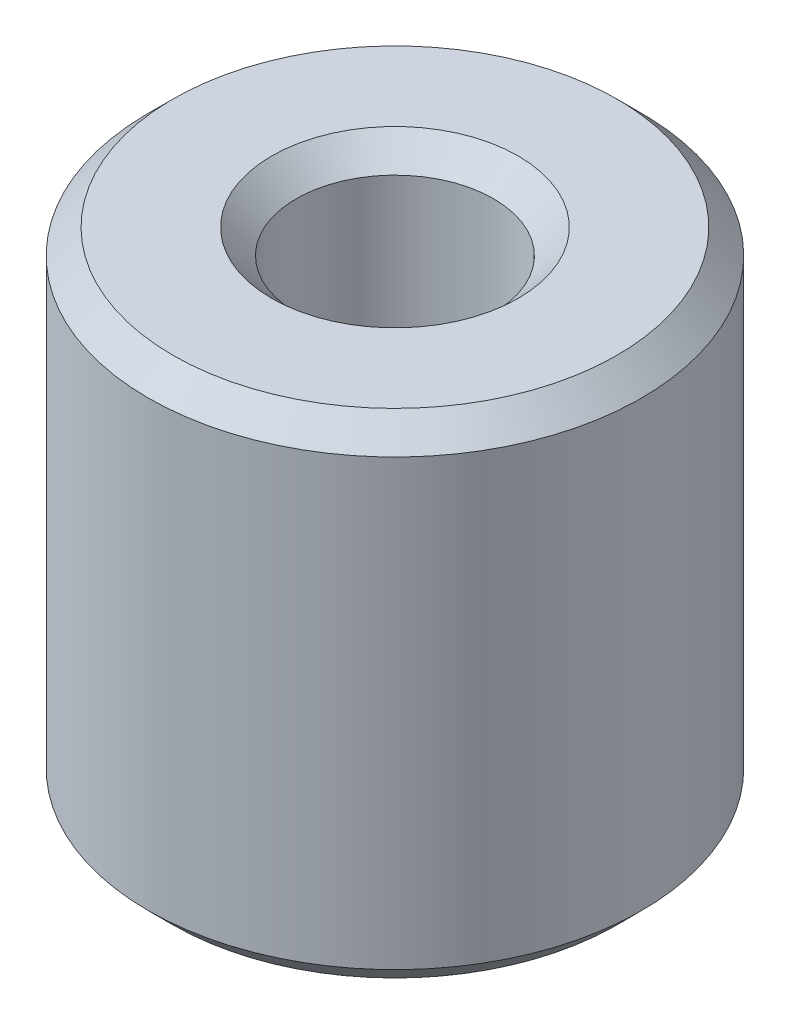
ISO-10303-21;
HEADER;
FILE_DESCRIPTION(('STEP AP214'),'2;1');
FILE_NAME('part.step','',(''),(''),'','','');
FILE_SCHEMA(('AUTOMOTIVE_DESIGN { 1 0 10303 214 1 1 1 1 }'));
ENDSEC;
DATA;
#1=APPLICATION_CONTEXT('core data for automotive mechanical design processes');
#2=APPLICATION_PROTOCOL_DEFINITION('international standard','automotive_design',2000,#1);
#3=PRODUCT_CONTEXT('',#1,'mechanical');
#4=PRODUCT('Part','Part','',(#3));
#5=PRODUCT_RELATED_PRODUCT_CATEGORY('part','',(#4));
#6=PRODUCT_DEFINITION_FORMATION('','',#4);
#7=PRODUCT_DEFINITION_CONTEXT('part definition',#1,'design');
#8=PRODUCT_DEFINITION('design','',#6,#7);
#9=PRODUCT_DEFINITION_SHAPE('','',#8);
#10=(LENGTH_UNIT() NAMED_UNIT(*) SI_UNIT(.MILLI.,.METRE.));
#11=(NAMED_UNIT(*) PLANE_ANGLE_UNIT() SI_UNIT($,.RADIAN.));
#12=(NAMED_UNIT(*) SI_UNIT($,.STERADIAN.) SOLID_ANGLE_UNIT());
#13=UNCERTAINTY_MEASURE_WITH_UNIT(LENGTH_MEASURE(1.E-05),#10,'distance_accuracy_value','');
#14=(GEOMETRIC_REPRESENTATION_CONTEXT(3) GLOBAL_UNCERTAINTY_ASSIGNED_CONTEXT((#13)) GLOBAL_UNIT_ASSIGNED_CONTEXT((#10,
#11,#12)) REPRESENTATION_CONTEXT('',''));
#15=CARTESIAN_POINT('',(0.,0.,0.));
#16=DIRECTION('',(0.,0.,1.));
#17=DIRECTION('',(1.,0.,0.));
#18=AXIS2_PLACEMENT_3D('',#15,#16,#17);
#19=CARTESIAN_POINT('',(0.,8.,0.));
#20=DIRECTION('',(0.,1.,0.));
#21=DIRECTION('',(0.,0.,1.));
#22=AXIS2_PLACEMENT_3D('',#19,#20,#21);
#23=PLANE('',#22);
#24=CARTESIAN_POINT('',(0.,8.,0.));
#25=DIRECTION('',(0.,1.,0.));
#26=DIRECTION('',(0.,0.,1.));
#27=AXIS2_PLACEMENT_3D('',#24,#25,#26);
#28=CIRCLE('',#27,2.);
#29=CARTESIAN_POINT('',(0.,8.,2.));
#30=VERTEX_POINT('',#29);
#31=EDGE_CURVE('E10',#30,#30,#28,.F.);
#32=ORIENTED_EDGE('',*,*,#31,.T.);
#33=EDGE_LOOP('',(#32));
#34=FACE_BOUND('',#33,.T.);
#35=CARTESIAN_POINT('',(0.,8.,0.));
#36=DIRECTION('',(0.,1.,0.));
#37=DIRECTION('',(0.,0.,1.));
#38=AXIS2_PLACEMENT_3D('',#35,#36,#37);
#39=CIRCLE('',#38,3.6);
#40=CARTESIAN_POINT('',(0.,8.,3.6));
#41=VERTEX_POINT('',#40);
#42=EDGE_CURVE('E44',#41,#41,#39,.T.);
#43=ORIENTED_EDGE('',*,*,#42,.T.);
#44=EDGE_LOOP('',(#43));
#45=FACE_BOUND('',#44,.T.);
#46=ADVANCED_FACE('F36',(#34,#45),#23,.T.);
#47=CARTESIAN_POINT('',(0.,0.,0.));
#48=DIRECTION('',(0.,1.,0.));
#49=DIRECTION('',(0.,0.,1.));
#50=AXIS2_PLACEMENT_3D('',#47,#48,#49);
#51=PLANE('',#50);
#52=CARTESIAN_POINT('',(0.,0.,0.));
#53=DIRECTION('',(0.,1.,0.));
#54=DIRECTION('',(0.,0.,1.));
#55=AXIS2_PLACEMENT_3D('',#52,#53,#54);
#56=CIRCLE('',#55,2.);
#57=CARTESIAN_POINT('',(0.,0.,2.));
#58=VERTEX_POINT('',#57);
#59=EDGE_CURVE('E63',#58,#58,#56,.T.);
#60=ORIENTED_EDGE('',*,*,#59,.T.);
#61=EDGE_LOOP('',(#60));
#62=FACE_BOUND('',#61,.T.);
#63=CARTESIAN_POINT('',(0.,0.,0.));
#64=DIRECTION('',(0.,1.,0.));
#65=DIRECTION('',(0.,0.,1.));
#66=AXIS2_PLACEMENT_3D('',#63,#64,#65);
#67=CIRCLE('',#66,3.6);
#68=CARTESIAN_POINT('',(0.,0.,3.6));
#69=VERTEX_POINT('',#68);
#70=EDGE_CURVE('E66',#69,#69,#67,.F.);
#71=ORIENTED_EDGE('',*,*,#70,.T.);
#72=EDGE_LOOP('',(#71));
#73=FACE_BOUND('',#72,.T.);
#74=ADVANCED_FACE('F70',(#62,#73),#51,.F.);
#75=CARTESIAN_POINT('',(0.,8.,0.));
#76=DIRECTION('',(0.,-1.,0.));
#77=DIRECTION('',(0.,0.,-1.));
#78=AXIS2_PLACEMENT_3D('',#75,#76,#77);
#79=CYLINDRICAL_SURFACE('',#78,4.);
#80=CARTESIAN_POINT('',(0.,0.399999999999998,0.));
#81=DIRECTION('',(0.,1.,0.));
#82=DIRECTION('',(0.,0.,1.));
#83=AXIS2_PLACEMENT_3D('',#80,#81,#82);
#84=CIRCLE('',#83,4.);
#85=CARTESIAN_POINT('',(0.,0.399999999999998,4.));
#86=VERTEX_POINT('',#85);
#87=EDGE_CURVE('E48',#86,#86,#84,.T.);
#88=ORIENTED_EDGE('',*,*,#87,.T.);
#89=EDGE_LOOP('',(#88));
#90=FACE_BOUND('',#89,.T.);
#91=CARTESIAN_POINT('',(0.,7.6,0.));
#92=DIRECTION('',(0.,1.,0.));
#93=DIRECTION('',(0.,0.,1.));
#94=AXIS2_PLACEMENT_3D('',#91,#92,#93);
#95=CIRCLE('',#94,4.);
#96=CARTESIAN_POINT('',(0.,7.6,4.));
#97=VERTEX_POINT('',#96);
#98=EDGE_CURVE('E52',#97,#97,#95,.F.);
#99=ORIENTED_EDGE('',*,*,#98,.T.);
#100=EDGE_LOOP('',(#99));
#101=FACE_BOUND('',#100,.T.);
#102=ADVANCED_FACE('F80',(#90,#101),#79,.T.);
#103=CARTESIAN_POINT('',(0.,8.,0.));
#104=DIRECTION('',(0.,-1.,0.));
#105=DIRECTION('',(0.,0.,-1.));
#106=AXIS2_PLACEMENT_3D('',#103,#104,#105);
#107=CYLINDRICAL_SURFACE('',#106,1.6);
#108=CARTESIAN_POINT('',(0.,0.400000000000002,0.));
#109=DIRECTION('',(0.,1.,0.));
#110=DIRECTION('',(0.,0.,1.));
#111=AXIS2_PLACEMENT_3D('',#108,#109,#110);
#112=CIRCLE('',#111,1.6);
#113=CARTESIAN_POINT('',(0.,0.400000000000002,1.6));
#114=VERTEX_POINT('',#113);
#115=EDGE_CURVE('E57',#114,#114,#112,.F.);
#116=ORIENTED_EDGE('',*,*,#115,.T.);
#117=EDGE_LOOP('',(#116));
#118=FACE_BOUND('',#117,.T.);
#119=CARTESIAN_POINT('',(0.,7.6,0.));
#120=DIRECTION('',(0.,1.,0.));
#121=DIRECTION('',(0.,0.,1.));
#122=AXIS2_PLACEMENT_3D('',#119,#120,#121);
#123=CIRCLE('',#122,1.6);
#124=CARTESIAN_POINT('',(0.,7.6,1.6));
#125=VERTEX_POINT('',#124);
#126=EDGE_CURVE('E60',#125,#125,#123,.T.);
#127=ORIENTED_EDGE('',*,*,#126,.T.);
#128=EDGE_LOOP('',(#127));
#129=FACE_BOUND('',#128,.T.);
#130=ADVANCED_FACE('F83',(#118,#129),#107,.F.);
#131=CARTESIAN_POINT('',(0.,0.,0.));
#132=DIRECTION('',(0.,-1.,0.));
#133=DIRECTION('',(0.,0.,-1.));
#134=AXIS2_PLACEMENT_3D('',#131,#132,#133);
#135=CONICAL_SURFACE('',#134,2.,0.785398163397444);
#136=ORIENTED_EDGE('',*,*,#115,.F.);
#137=EDGE_LOOP('',(#136));
#138=FACE_BOUND('',#137,.T.);
#139=ORIENTED_EDGE('',*,*,#59,.F.);
#140=EDGE_LOOP('',(#139));
#141=FACE_BOUND('',#140,.T.);
#142=ADVANCED_FACE('F76',(#138,#141),#135,.F.);
#143=CARTESIAN_POINT('',(0.,0.399999999999998,0.));
#144=DIRECTION('',(0.,1.,0.));
#145=DIRECTION('',(0.,0.,1.));
#146=AXIS2_PLACEMENT_3D('',#143,#144,#145);
#147=CONICAL_SURFACE('',#146,4.,0.785398163397452);
#148=ORIENTED_EDGE('',*,*,#70,.F.);
#149=EDGE_LOOP('',(#148));
#150=FACE_BOUND('',#149,.T.);
#151=ORIENTED_EDGE('',*,*,#87,.F.);
#152=EDGE_LOOP('',(#151));
#153=FACE_BOUND('',#152,.T.);
#154=ADVANCED_FACE('F72',(#150,#153),#147,.T.);
#155=CARTESIAN_POINT('',(0.,7.6,0.));
#156=DIRECTION('',(0.,1.,0.));
#157=DIRECTION('',(0.,0.,1.));
#158=AXIS2_PLACEMENT_3D('',#155,#156,#157);
#159=CONICAL_SURFACE('',#158,1.6,0.785398163397451);
#160=ORIENTED_EDGE('',*,*,#31,.F.);
#161=EDGE_LOOP('',(#160));
#162=FACE_BOUND('',#161,.T.);
#163=ORIENTED_EDGE('',*,*,#126,.F.);
#164=EDGE_LOOP('',(#163));
#165=FACE_BOUND('',#164,.T.);
#166=ADVANCED_FACE('F75',(#162,#165),#159,.F.);
#167=CARTESIAN_POINT('',(0.,8.,0.));
#168=DIRECTION('',(0.,-1.,0.));
#169=DIRECTION('',(0.,0.,-1.));
#170=AXIS2_PLACEMENT_3D('',#167,#168,#169);
#171=CONICAL_SURFACE('',#170,3.6,0.785398163397448);
#172=ORIENTED_EDGE('',*,*,#98,.F.);
#173=EDGE_LOOP('',(#172));
#174=FACE_BOUND('',#173,.T.);
#175=ORIENTED_EDGE('',*,*,#42,.F.);
#176=EDGE_LOOP('',(#175));
#177=FACE_BOUND('',#176,.T.);
#178=ADVANCED_FACE('F39',(#174,#177),#171,.T.);
#179=CLOSED_SHELL('',(#46,#74,#102,#130,#142,#154,#166,#178));
#180=MANIFOLD_SOLID_BREP('B2',#179);
#181=ADVANCED_BREP_SHAPE_REPRESENTATION('',(#18,#180),#14);
#182=SHAPE_DEFINITION_REPRESENTATION(#9,#181);
ENDSEC;
END-ISO-10303-21;
